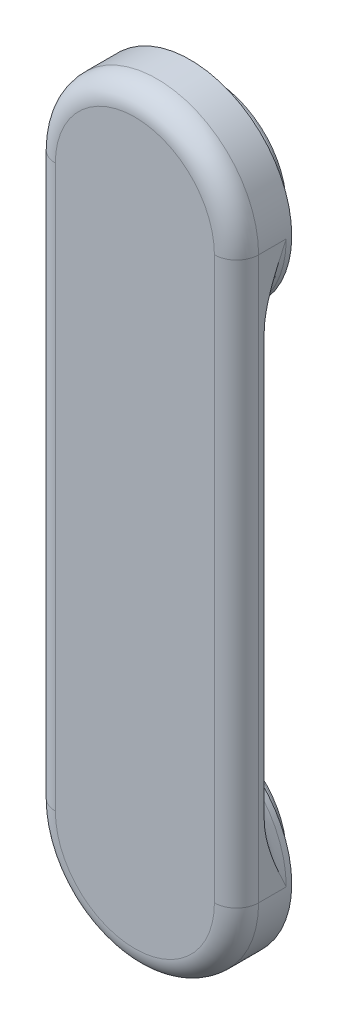
ISO-10303-21;
HEADER;
FILE_DESCRIPTION(('STEP AP214'),'2;1');
FILE_NAME('part.step','',(''),(''),'','','');
FILE_SCHEMA(('AUTOMOTIVE_DESIGN { 1 0 10303 214 1 1 1 1 }'));
ENDSEC;
DATA;
#1=APPLICATION_CONTEXT('core data for automotive mechanical design processes');
#2=APPLICATION_PROTOCOL_DEFINITION('international standard','automotive_design',2000,#1);
#3=PRODUCT_CONTEXT('',#1,'mechanical');
#4=PRODUCT('Part','Part','',(#3));
#5=PRODUCT_RELATED_PRODUCT_CATEGORY('part','',(#4));
#6=PRODUCT_DEFINITION_FORMATION('','',#4);
#7=PRODUCT_DEFINITION_CONTEXT('part definition',#1,'design');
#8=PRODUCT_DEFINITION('design','',#6,#7);
#9=PRODUCT_DEFINITION_SHAPE('','',#8);
#10=(LENGTH_UNIT() NAMED_UNIT(*) SI_UNIT(.MILLI.,.METRE.));
#11=(NAMED_UNIT(*) PLANE_ANGLE_UNIT() SI_UNIT($,.RADIAN.));
#12=(NAMED_UNIT(*) SI_UNIT($,.STERADIAN.) SOLID_ANGLE_UNIT());
#13=UNCERTAINTY_MEASURE_WITH_UNIT(LENGTH_MEASURE(1.E-05),#10,'distance_accuracy_value','');
#14=(GEOMETRIC_REPRESENTATION_CONTEXT(3) GLOBAL_UNCERTAINTY_ASSIGNED_CONTEXT((#13)) GLOBAL_UNIT_ASSIGNED_CONTEXT((#10,
#11,#12)) REPRESENTATION_CONTEXT('',''));
#15=CARTESIAN_POINT('',(0.,0.,0.));
#16=DIRECTION('',(0.,0.,1.));
#17=DIRECTION('',(1.,0.,0.));
#18=AXIS2_PLACEMENT_3D('',#15,#16,#17);
#19=CARTESIAN_POINT('',(0.,-31.75,3.125));
#20=DIRECTION('',(0.,0.,-1.));
#21=DIRECTION('',(-1.,0.,0.));
#22=AXIS2_PLACEMENT_3D('',#19,#20,#21);
#23=CYLINDRICAL_SURFACE('',#22,11.5);
#24=DIRECTION('',(0.,0.,-1.));
#25=VECTOR('',#24,1.);
#26=CARTESIAN_POINT('',(11.5,-31.75,3.125));
#27=LINE('',#26,#25);
#28=CARTESIAN_POINT('',(11.5,-31.75,0.625));
#29=VERTEX_POINT('',#28);
#30=CARTESIAN_POINT('',(11.5,-31.75,-2.5));
#31=VERTEX_POINT('',#30);
#32=EDGE_CURVE('E134',#29,#31,#27,.T.);
#33=ORIENTED_EDGE('',*,*,#32,.F.);
#34=CARTESIAN_POINT('',(0.,-31.75,0.625));
#35=DIRECTION('',(0.,0.,1.));
#36=DIRECTION('',(1.,0.,0.));
#37=AXIS2_PLACEMENT_3D('',#34,#35,#36);
#38=CIRCLE('',#37,11.5);
#39=CARTESIAN_POINT('',(-11.5,-31.75,0.625));
#40=VERTEX_POINT('',#39);
#41=EDGE_CURVE('E119',#29,#40,#38,.F.);
#42=ORIENTED_EDGE('',*,*,#41,.T.);
#43=DIRECTION('',(0.,0.,-1.));
#44=VECTOR('',#43,1.);
#45=CARTESIAN_POINT('',(-11.5,-31.75,3.125));
#46=LINE('',#45,#44);
#47=CARTESIAN_POINT('',(-11.5,-31.75,-2.5));
#48=VERTEX_POINT('',#47);
#49=EDGE_CURVE('E325',#40,#48,#46,.T.);
#50=ORIENTED_EDGE('',*,*,#49,.T.);
#51=CARTESIAN_POINT('',(0.,-31.75,-2.5));
#52=DIRECTION('',(0.,0.,1.));
#53=DIRECTION('',(1.,0.,0.));
#54=AXIS2_PLACEMENT_3D('',#51,#52,#53);
#55=CIRCLE('',#54,11.5);
#56=EDGE_CURVE('E141',#48,#31,#55,.F.);
#57=ORIENTED_EDGE('',*,*,#56,.T.);
#58=EDGE_LOOP('',(#33,#42,#50,#57));
#59=FACE_BOUND('',#58,.T.);
#60=CARTESIAN_POINT('',(0.,-31.75,-3.125));
#61=DIRECTION('',(0.,0.,1.));
#62=DIRECTION('',(1.,0.,0.));
#63=AXIS2_PLACEMENT_3D('',#60,#61,#62);
#64=CIRCLE('',#63,11.5);
#65=CARTESIAN_POINT('',(11.5,-31.75,-3.125));
#66=VERTEX_POINT('',#65);
#67=EDGE_CURVE('E310',#66,#66,#64,.T.);
#68=ORIENTED_EDGE('',*,*,#67,.T.);
#69=EDGE_LOOP('',(#68));
#70=FACE_BOUND('',#69,.T.);
#71=ADVANCED_FACE('F43',(#59,#70),#23,.T.);
#72=CARTESIAN_POINT('',(11.5,-31.75,3.125));
#73=DIRECTION('',(-1.,0.,0.));
#74=DIRECTION('',(0.,-1.,0.));
#75=AXIS2_PLACEMENT_3D('',#72,#73,#74);
#76=PLANE('',#75);
#77=DIRECTION('',(0.,0.,-1.));
#78=VECTOR('',#77,1.);
#79=CARTESIAN_POINT('',(11.5,31.75,3.125));
#80=LINE('',#79,#78);
#81=CARTESIAN_POINT('',(11.5,31.75,0.625));
#82=VERTEX_POINT('',#81);
#83=CARTESIAN_POINT('',(11.5,31.75,-2.5));
#84=VERTEX_POINT('',#83);
#85=EDGE_CURVE('E273',#82,#84,#80,.T.);
#86=ORIENTED_EDGE('',*,*,#85,.F.);
#87=DIRECTION('',(0.,1.,0.));
#88=VECTOR('',#87,1.);
#89=CARTESIAN_POINT('',(11.5,-31.75,0.625));
#90=LINE('',#89,#88);
#91=EDGE_CURVE('E162',#82,#29,#90,.F.);
#92=ORIENTED_EDGE('',*,*,#91,.T.);
#93=ORIENTED_EDGE('',*,*,#32,.T.);
#94=CARTESIAN_POINT('',(11.5,-23.7656402886643,0.));
#95=CARTESIAN_POINT('',(11.5,-23.9112332765883,-1.69908867049003E-05));
#96=CARTESIAN_POINT('',(11.5,-24.056780865209,-0.00413564646090326));
#97=CARTESIAN_POINT('',(11.5,-24.3473991352482,-0.0197827491517628));
#98=CARTESIAN_POINT('',(11.5,-24.4924700442411,-0.0313068988774172));
#99=CARTESIAN_POINT('',(11.5,-24.7815009163115,-0.0609305173504692));
#100=CARTESIAN_POINT('',(11.5,-24.9254628768635,-0.0790109239362852));
#101=CARTESIAN_POINT('',(11.5,-25.21253268519,-0.121081398249559));
#102=CARTESIAN_POINT('',(11.5,-25.3556403926035,-0.145072411174061));
#103=CARTESIAN_POINT('',(11.5,-25.7800827335397,-0.224345309413682));
#104=CARTESIAN_POINT('',(11.5,-26.0599959733642,-0.287312732189337));
#105=CARTESIAN_POINT('',(11.5,-26.6156937928833,-0.429871238840553));
#106=CARTESIAN_POINT('',(11.5,-26.8914746704327,-0.509476373420187));
#107=CARTESIAN_POINT('',(11.5,-27.557721963974,-0.719328390781007));
#108=CARTESIAN_POINT('',(11.5,-27.9459758666787,-0.856553607015504));
#109=CARTESIAN_POINT('',(11.5,-28.7151363990286,-1.14983582712574));
#110=CARTESIAN_POINT('',(11.5,-29.0960429631535,-1.30589299884675));
#111=CARTESIAN_POINT('',(11.5,-30.2334696101406,-1.79296918468285));
#112=CARTESIAN_POINT('',(11.5,-30.9821411112047,-2.1419844139502));
#113=CARTESIAN_POINT('',(11.5,-31.7370409800875,-2.49395784005255));
#114=CARTESIAN_POINT('',(11.5,-31.7435204961502,-2.49697893017245));
#115=CARTESIAN_POINT('',(11.5,-31.75,-2.5));
#116=B_SPLINE_CURVE_WITH_KNOTS('',3,(#94,#95,#96,#97,#98,#99,#100,#101,#102,#103,#104,#105,#106,
#107,#108,#109,#110,#111,#112,#113,#114,#115),.UNSPECIFIED.,.F.,.F.,(4,2,2,2,2,2,2,2,2,2,4),(0.,
0.436655710143634,0.873058258536552,1.3082020189555,1.74341541078733,2.60342762133257,
3.46416907639028,4.69875550959814,5.93335294722909,8.41066469203298,8.43211230262252),.UNSPECIFIED.);
#117=CARTESIAN_POINT('',(11.5,-23.7656402886643,0.));
#118=VERTEX_POINT('',#117);
#119=EDGE_CURVE('E68',#31,#118,#116,.F.);
#120=ORIENTED_EDGE('',*,*,#119,.T.);
#121=DIRECTION('',(0.,1.,0.));
#122=VECTOR('',#121,1.);
#123=CARTESIAN_POINT('',(11.5,-31.75,0.));
#124=LINE('',#123,#122);
#125=CARTESIAN_POINT('',(11.5,23.7656402886643,0.));
#126=VERTEX_POINT('',#125);
#127=EDGE_CURVE('E318',#118,#126,#124,.T.);
#128=ORIENTED_EDGE('',*,*,#127,.T.);
#129=CARTESIAN_POINT('',(11.5,23.7656402886643,0.));
#130=CARTESIAN_POINT('',(11.5,23.9112332765897,-1.69908867060878E-05));
#131=CARTESIAN_POINT('',(11.5,24.0567808652118,-0.00413564646098504));
#132=CARTESIAN_POINT('',(11.5,24.3473991352539,-0.0197827491521442));
#133=CARTESIAN_POINT('',(11.5,24.4924700442483,-0.0313068988780174));
#134=CARTESIAN_POINT('',(11.5,24.7815009163211,-0.0609305173515929));
#135=CARTESIAN_POINT('',(11.5,24.9254628768743,-0.0790109239376994));
#136=CARTESIAN_POINT('',(11.5,25.2125326852029,-0.121081398251619));
#137=CARTESIAN_POINT('',(11.5,25.3556403926175,-0.145072411176477));
#138=CARTESIAN_POINT('',(11.5,25.780082733552,-0.224345309416388));
#139=CARTESIAN_POINT('',(11.5,26.0599959733737,-0.287312732191754));
#140=CARTESIAN_POINT('',(11.5,26.6156937928879,-0.429871238841785));
#141=CARTESIAN_POINT('',(11.5,26.8914746704351,-0.50947637342054));
#142=CARTESIAN_POINT('',(11.5,27.5577219639734,-0.719328390781427));
#143=CARTESIAN_POINT('',(11.5,27.9459758666769,-0.856553607017628));
#144=CARTESIAN_POINT('',(11.5,28.7151363990278,-1.14983582712267));
#145=CARTESIAN_POINT('',(11.5,29.0960429631549,-1.30589299883675));
#146=CARTESIAN_POINT('',(11.4999999999999,30.2334696101298,-1.79296918469958));
#147=CARTESIAN_POINT('',(11.4999999999995,30.9821411111579,-2.14198441404739));
#148=CARTESIAN_POINT('',(11.5,31.7370409800867,-2.49395784005423));
#149=CARTESIAN_POINT('',(11.5,31.7435204961498,-2.4969789301733));
#150=CARTESIAN_POINT('',(11.5,31.75,-2.5));
#151=B_SPLINE_CURVE_WITH_KNOTS('',3,(#129,#130,#131,#132,#133,#134,#135,#136,#137,#138,#139,
#140,#141,#142,#143,#144,#145,#146,#147,#148,#149,#150),.UNSPECIFIED.,.F.,.F.,(4,2,2,2,2,2,2,2,
2,2,4),(0.,0.436655710147938,0.873058258545157,1.30820201896747,1.74341541080268,
2.60342762133974,3.46416907639027,4.69875550959711,5.93335294722513,8.41066469203293,
8.43211230262251),.UNSPECIFIED.);
#152=EDGE_CURVE('E53',#126,#84,#151,.T.);
#153=ORIENTED_EDGE('',*,*,#152,.T.);
#154=EDGE_LOOP('',(#86,#92,#93,#120,#128,#153));
#155=FACE_BOUND('',#154,.T.);
#156=ADVANCED_FACE('F241',(#155),#76,.F.);
#157=CARTESIAN_POINT('',(0.,31.75,3.125));
#158=DIRECTION('',(0.,0.,-1.));
#159=DIRECTION('',(-1.,0.,0.));
#160=AXIS2_PLACEMENT_3D('',#157,#158,#159);
#161=CYLINDRICAL_SURFACE('',#160,11.5);
#162=DIRECTION('',(0.,0.,-1.));
#163=VECTOR('',#162,1.);
#164=CARTESIAN_POINT('',(-11.5,31.75,3.125));
#165=LINE('',#164,#163);
#166=CARTESIAN_POINT('',(-11.5,31.75,0.625));
#167=VERTEX_POINT('',#166);
#168=CARTESIAN_POINT('',(-11.5,31.75,-2.5));
#169=VERTEX_POINT('',#168);
#170=EDGE_CURVE('E279',#167,#169,#165,.T.);
#171=ORIENTED_EDGE('',*,*,#170,.F.);
#172=CARTESIAN_POINT('',(0.,31.75,0.625));
#173=DIRECTION('',(0.,0.,1.));
#174=DIRECTION('',(1.,0.,0.));
#175=AXIS2_PLACEMENT_3D('',#172,#173,#174);
#176=CIRCLE('',#175,11.5);
#177=EDGE_CURVE('E159',#167,#82,#176,.F.);
#178=ORIENTED_EDGE('',*,*,#177,.T.);
#179=ORIENTED_EDGE('',*,*,#85,.T.);
#180=CARTESIAN_POINT('',(0.,31.75,-2.5));
#181=DIRECTION('',(0.,0.,1.));
#182=DIRECTION('',(1.,0.,0.));
#183=AXIS2_PLACEMENT_3D('',#180,#181,#182);
#184=CIRCLE('',#183,11.5);
#185=EDGE_CURVE('E155',#84,#169,#184,.F.);
#186=ORIENTED_EDGE('',*,*,#185,.T.);
#187=EDGE_LOOP('',(#171,#178,#179,#186));
#188=FACE_BOUND('',#187,.T.);
#189=CARTESIAN_POINT('',(0.,31.75,-3.125));
#190=DIRECTION('',(0.,0.,1.));
#191=DIRECTION('',(1.,0.,0.));
#192=AXIS2_PLACEMENT_3D('',#189,#190,#191);
#193=CIRCLE('',#192,11.5);
#194=CARTESIAN_POINT('',(11.5,31.75,-3.125));
#195=VERTEX_POINT('',#194);
#196=EDGE_CURVE('E314',#195,#195,#193,.T.);
#197=ORIENTED_EDGE('',*,*,#196,.T.);
#198=EDGE_LOOP('',(#197));
#199=FACE_BOUND('',#198,.T.);
#200=ADVANCED_FACE('F213',(#188,#199),#161,.T.);
#201=CARTESIAN_POINT('',(-11.5,-31.75,3.125));
#202=DIRECTION('',(-1.,0.,0.));
#203=DIRECTION('',(0.,-1.,0.));
#204=AXIS2_PLACEMENT_3D('',#201,#202,#203);
#205=PLANE('',#204);
#206=ORIENTED_EDGE('',*,*,#49,.F.);
#207=DIRECTION('',(0.,1.,0.));
#208=VECTOR('',#207,1.);
#209=CARTESIAN_POINT('',(-11.5,-31.75,0.625));
#210=LINE('',#209,#208);
#211=EDGE_CURVE('E152',#40,#167,#210,.T.);
#212=ORIENTED_EDGE('',*,*,#211,.T.);
#213=ORIENTED_EDGE('',*,*,#170,.T.);
#214=CARTESIAN_POINT('',(-11.5,23.7656402886644,0.));
#215=CARTESIAN_POINT('',(-11.5,23.9112332765866,-1.69908867029895E-05));
#216=CARTESIAN_POINT('',(-11.5,24.0567808652056,-0.00413564646080526));
#217=CARTESIAN_POINT('',(-11.5,24.3473991352414,-0.0197827491513075));
#218=CARTESIAN_POINT('',(-11.5,24.4924700442326,-0.0313068988767003));
#219=CARTESIAN_POINT('',(-11.5,24.7815009162999,-0.0609305173491256));
#220=CARTESIAN_POINT('',(-11.5,24.9254628768506,-0.0790109239345935));
#221=CARTESIAN_POINT('',(-11.5,25.2125326851745,-0.121081398247092));
#222=CARTESIAN_POINT('',(-11.5,25.3556403925868,-0.145072411171168));
#223=CARTESIAN_POINT('',(-11.5,25.7800827335249,-0.224345309410443));
#224=CARTESIAN_POINT('',(-11.5,26.0599959733527,-0.287312732186443));
#225=CARTESIAN_POINT('',(-11.5,26.6156937928778,-0.429871238839078));
#226=CARTESIAN_POINT('',(-11.5,26.8914746704298,-0.509476373419765));
#227=CARTESIAN_POINT('',(-11.5,27.5577219639747,-0.719328390780504));
#228=CARTESIAN_POINT('',(-11.5,27.9459758666808,-0.856553607012958));
#229=CARTESIAN_POINT('',(-11.5,28.7151363990296,-1.14983582712941));
#230=CARTESIAN_POINT('',(-11.5,29.0960429631519,-1.30589299885872));
#231=CARTESIAN_POINT('',(-11.5000000000001,30.2334696101534,-1.79296918466283));
#232=CARTESIAN_POINT('',(-11.5000000000002,30.9821411112606,-2.14198441383391));
#233=CARTESIAN_POINT('',(-11.5,31.7370409800884,-2.49395784005052));
#234=CARTESIAN_POINT('',(-11.5,31.7435204961507,-2.49697893017143));
#235=CARTESIAN_POINT('',(-11.5,31.75,-2.5));
#236=B_SPLINE_CURVE_WITH_KNOTS('',3,(#214,#215,#216,#217,#218,#219,#220,#221,#222,#223,#224,
#225,#226,#227,#228,#229,#230,#231,#232,#233,#234,#235),.UNSPECIFIED.,.F.,.F.,(4,2,2,2,2,2,2,2,
2,2,4),(0.,0.436655710138497,0.87305825852626,1.30820201894116,1.74341541076897,
2.60342762132397,3.4641690763903,4.69875550959936,5.93335294723379,8.41066469203296,
8.43211230262254),.UNSPECIFIED.);
#237=CARTESIAN_POINT('',(-11.5,23.7656402886644,0.));
#238=VERTEX_POINT('',#237);
#239=EDGE_CURVE('E11',#169,#238,#236,.F.);
#240=ORIENTED_EDGE('',*,*,#239,.T.);
#241=DIRECTION('',(0.,1.,0.));
#242=VECTOR('',#241,1.);
#243=CARTESIAN_POINT('',(-11.5,-31.75,0.));
#244=LINE('',#243,#242);
#245=CARTESIAN_POINT('',(-11.5,-23.7656402886643,0.));
#246=VERTEX_POINT('',#245);
#247=EDGE_CURVE('E321',#246,#238,#244,.T.);
#248=ORIENTED_EDGE('',*,*,#247,.F.);
#249=CARTESIAN_POINT('',(-11.5,-23.7656402886643,0.));
#250=CARTESIAN_POINT('',(-11.5,-23.9112332765883,-1.69908867046995E-05));
#251=CARTESIAN_POINT('',(-11.5,-24.056780865209,-0.00413564646090278));
#252=CARTESIAN_POINT('',(-11.5,-24.3473991352482,-0.019782749151761));
#253=CARTESIAN_POINT('',(-11.5,-24.4924700442411,-0.0313068988774142));
#254=CARTESIAN_POINT('',(-11.5,-24.7815009163114,-0.0609305173504628));
#255=CARTESIAN_POINT('',(-11.5,-24.9254628768635,-0.0790109239362767));
#256=CARTESIAN_POINT('',(-11.5,-25.2125326851899,-0.121081398249547));
#257=CARTESIAN_POINT('',(-11.5,-25.3556403926035,-0.145072411174047));
#258=CARTESIAN_POINT('',(-11.5,-25.7800827335396,-0.224345309413669));
#259=CARTESIAN_POINT('',(-11.5,-26.0599959733641,-0.287312732189325));
#260=CARTESIAN_POINT('',(-11.5,-26.6156937928833,-0.429871238840548));
#261=CARTESIAN_POINT('',(-11.5,-26.8914746704327,-0.509476373420186));
#262=CARTESIAN_POINT('',(-11.5,-27.557721963974,-0.719328390781006));
#263=CARTESIAN_POINT('',(-11.5,-27.9459758666787,-0.856553607015494));
#264=CARTESIAN_POINT('',(-11.5,-28.7151363990286,-1.14983582712576));
#265=CARTESIAN_POINT('',(-11.5,-29.0960429631535,-1.3058929988468));
#266=CARTESIAN_POINT('',(-11.5,-30.2334696101406,-1.79296918468277));
#267=CARTESIAN_POINT('',(-11.5,-30.9821411112049,-2.14198441394972));
#268=CARTESIAN_POINT('',(-11.5,-31.7370409800875,-2.49395784005254));
#269=CARTESIAN_POINT('',(-11.5,-31.7435204961502,-2.49697893017244));
#270=CARTESIAN_POINT('',(-11.5,-31.75,-2.5));
#271=B_SPLINE_CURVE_WITH_KNOTS('',3,(#249,#250,#251,#252,#253,#254,#255,#256,#257,#258,#259,
#260,#261,#262,#263,#264,#265,#266,#267,#268,#269,#270),.UNSPECIFIED.,.F.,.F.,(4,2,2,2,2,2,2,2,
2,2,4),(0.,0.436655710143613,0.873058258536507,1.30820201895543,1.74341541078726,
2.60342762133253,3.46416907639029,4.69875550959815,5.93335294722911,8.41066469203297,
8.43211230262252),.UNSPECIFIED.);
#272=EDGE_CURVE('E188',#246,#48,#271,.T.);
#273=ORIENTED_EDGE('',*,*,#272,.T.);
#274=EDGE_LOOP('',(#206,#212,#213,#240,#248,#273));
#275=FACE_BOUND('',#274,.T.);
#276=ADVANCED_FACE('F208',(#275),#205,.T.);
#277=CARTESIAN_POINT('',(0.,-31.75,3.125));
#278=DIRECTION('',(0.,0.,1.));
#279=DIRECTION('',(1.,0.,0.));
#280=AXIS2_PLACEMENT_3D('',#277,#278,#279);
#281=PLANE('',#280);
#282=DIRECTION('',(0.,1.,0.));
#283=VECTOR('',#282,1.);
#284=CARTESIAN_POINT('',(-9.00000000000001,-31.75,3.125));
#285=LINE('',#284,#283);
#286=CARTESIAN_POINT('',(-9.00000000000001,31.75,3.125));
#287=VERTEX_POINT('',#286);
#288=CARTESIAN_POINT('',(-9.00000000000001,-31.75,3.125));
#289=VERTEX_POINT('',#288);
#290=EDGE_CURVE('E138',#287,#289,#285,.F.);
#291=ORIENTED_EDGE('',*,*,#290,.T.);
#292=CARTESIAN_POINT('',(0.,-31.75,3.125));
#293=DIRECTION('',(0.,0.,1.));
#294=DIRECTION('',(1.,0.,0.));
#295=AXIS2_PLACEMENT_3D('',#292,#293,#294);
#296=CIRCLE('',#295,9.00000000000001);
#297=CARTESIAN_POINT('',(9.00000000000001,-31.75,3.125));
#298=VERTEX_POINT('',#297);
#299=EDGE_CURVE('E117',#289,#298,#296,.T.);
#300=ORIENTED_EDGE('',*,*,#299,.T.);
#301=DIRECTION('',(0.,1.,0.));
#302=VECTOR('',#301,1.);
#303=CARTESIAN_POINT('',(8.99999999999999,31.75,3.125));
#304=LINE('',#303,#302);
#305=CARTESIAN_POINT('',(8.99999999999999,31.75,3.125));
#306=VERTEX_POINT('',#305);
#307=EDGE_CURVE('E126',#298,#306,#304,.T.);
#308=ORIENTED_EDGE('',*,*,#307,.T.);
#309=CARTESIAN_POINT('',(0.,31.75,3.125));
#310=DIRECTION('',(0.,0.,1.));
#311=DIRECTION('',(1.,0.,0.));
#312=AXIS2_PLACEMENT_3D('',#309,#310,#311);
#313=CIRCLE('',#312,9.00000000000001);
#314=EDGE_CURVE('E133',#306,#287,#313,.T.);
#315=ORIENTED_EDGE('',*,*,#314,.T.);
#316=EDGE_LOOP('',(#291,#300,#308,#315));
#317=FACE_BOUND('',#316,.T.);
#318=ADVANCED_FACE('F136',(#317),#281,.T.);
#319=CARTESIAN_POINT('',(0.,-31.75,0.));
#320=DIRECTION('',(0.,0.,1.));
#321=DIRECTION('',(1.,0.,0.));
#322=AXIS2_PLACEMENT_3D('',#319,#320,#321);
#323=PLANE('',#322);
#324=ORIENTED_EDGE('',*,*,#127,.F.);
#325=CARTESIAN_POINT('',(0.,-31.75,0.));
#326=DIRECTION('',(0.,0.,1.));
#327=DIRECTION('',(1.,0.,0.));
#328=AXIS2_PLACEMENT_3D('',#325,#326,#327);
#329=CIRCLE('',#328,14.);
#330=EDGE_CURVE('E168',#118,#246,#329,.T.);
#331=ORIENTED_EDGE('',*,*,#330,.T.);
#332=ORIENTED_EDGE('',*,*,#247,.T.);
#333=CARTESIAN_POINT('',(0.,31.75,0.));
#334=DIRECTION('',(0.,0.,1.));
#335=DIRECTION('',(1.,0.,0.));
#336=AXIS2_PLACEMENT_3D('',#333,#334,#335);
#337=CIRCLE('',#336,14.);
#338=EDGE_CURVE('E165',#238,#126,#337,.T.);
#339=ORIENTED_EDGE('',*,*,#338,.T.);
#340=EDGE_LOOP('',(#324,#331,#332,#339));
#341=FACE_BOUND('',#340,.T.);
#342=ADVANCED_FACE('F215',(#341),#323,.F.);
#343=CARTESIAN_POINT('',(0.,31.75,-3.125));
#344=DIRECTION('',(0.,0.,1.));
#345=DIRECTION('',(1.,0.,0.));
#346=AXIS2_PLACEMENT_3D('',#343,#344,#345);
#347=PLANE('',#346);
#348=CARTESIAN_POINT('',(0.,31.75,-3.125));
#349=DIRECTION('',(0.,0.,1.));
#350=DIRECTION('',(1.,0.,0.));
#351=AXIS2_PLACEMENT_3D('',#348,#349,#350);
#352=CIRCLE('',#351,10.75);
#353=CARTESIAN_POINT('',(10.75,31.75,-3.125));
#354=VERTEX_POINT('',#353);
#355=EDGE_CURVE('E180',#354,#354,#352,.T.);
#356=ORIENTED_EDGE('',*,*,#355,.T.);
#357=EDGE_LOOP('',(#356));
#358=FACE_BOUND('',#357,.T.);
#359=ORIENTED_EDGE('',*,*,#196,.F.);
#360=EDGE_LOOP('',(#359));
#361=FACE_BOUND('',#360,.T.);
#362=ADVANCED_FACE('F339',(#358,#361),#347,.F.);
#363=CARTESIAN_POINT('',(0.,-31.75,-3.125));
#364=DIRECTION('',(0.,0.,1.));
#365=DIRECTION('',(1.,0.,0.));
#366=AXIS2_PLACEMENT_3D('',#363,#364,#365);
#367=PLANE('',#366);
#368=CARTESIAN_POINT('',(0.,-31.75,-3.125));
#369=DIRECTION('',(0.,0.,1.));
#370=DIRECTION('',(1.,0.,0.));
#371=AXIS2_PLACEMENT_3D('',#368,#369,#370);
#372=CIRCLE('',#371,10.75);
#373=CARTESIAN_POINT('',(10.75,-31.75,-3.125));
#374=VERTEX_POINT('',#373);
#375=EDGE_CURVE('E172',#374,#374,#372,.T.);
#376=ORIENTED_EDGE('',*,*,#375,.T.);
#377=EDGE_LOOP('',(#376));
#378=FACE_BOUND('',#377,.T.);
#379=ORIENTED_EDGE('',*,*,#67,.F.);
#380=EDGE_LOOP('',(#379));
#381=FACE_BOUND('',#380,.T.);
#382=ADVANCED_FACE('F344',(#378,#381),#367,.F.);
#383=CARTESIAN_POINT('',(0.,31.75,-5.75));
#384=DIRECTION('',(0.,0.,1.));
#385=DIRECTION('',(1.,0.,0.));
#386=AXIS2_PLACEMENT_3D('',#383,#384,#385);
#387=CYLINDRICAL_SURFACE('',#386,8.25);
#388=CARTESIAN_POINT('',(0.,31.75,-5.625));
#389=DIRECTION('',(0.,0.,1.));
#390=DIRECTION('',(1.,0.,0.));
#391=AXIS2_PLACEMENT_3D('',#388,#389,#390);
#392=CIRCLE('',#391,8.25);
#393=CARTESIAN_POINT('',(8.25,31.75,-5.625));
#394=VERTEX_POINT('',#393);
#395=EDGE_CURVE('E184',#394,#394,#392,.F.);
#396=ORIENTED_EDGE('',*,*,#395,.T.);
#397=EDGE_LOOP('',(#396));
#398=FACE_BOUND('',#397,.T.);
#399=CARTESIAN_POINT('',(0.,31.75,-5.75));
#400=DIRECTION('',(0.,0.,1.));
#401=DIRECTION('',(1.,0.,0.));
#402=AXIS2_PLACEMENT_3D('',#399,#400,#401);
#403=CIRCLE('',#402,8.25);
#404=CARTESIAN_POINT('',(8.25,31.75,-5.75));
#405=VERTEX_POINT('',#404);
#406=EDGE_CURVE('E306',#405,#405,#403,.T.);
#407=ORIENTED_EDGE('',*,*,#406,.T.);
#408=EDGE_LOOP('',(#407));
#409=FACE_BOUND('',#408,.T.);
#410=ADVANCED_FACE('F352',(#398,#409),#387,.T.);
#411=CARTESIAN_POINT('',(0.,31.75,-5.75));
#412=DIRECTION('',(0.,0.,1.));
#413=DIRECTION('',(1.,0.,0.));
#414=AXIS2_PLACEMENT_3D('',#411,#412,#413);
#415=PLANE('',#414);
#416=CARTESIAN_POINT('',(0.,31.75,-5.75));
#417=DIRECTION('',(0.,0.,-1.));
#418=DIRECTION('',(-1.,0.,0.));
#419=AXIS2_PLACEMENT_3D('',#416,#417,#418);
#420=CIRCLE('',#419,7.5);
#421=CARTESIAN_POINT('',(-7.5,31.75,-5.75));
#422=VERTEX_POINT('',#421);
#423=EDGE_CURVE('E294',#422,#422,#420,.T.);
#424=ORIENTED_EDGE('',*,*,#423,.F.);
#425=EDGE_LOOP('',(#424));
#426=FACE_BOUND('',#425,.T.);
#427=ORIENTED_EDGE('',*,*,#406,.F.);
#428=EDGE_LOOP('',(#427));
#429=FACE_BOUND('',#428,.T.);
#430=ADVANCED_FACE('F356',(#426,#429),#415,.F.);
#431=CARTESIAN_POINT('',(0.,-31.75,-5.75));
#432=DIRECTION('',(0.,0.,1.));
#433=DIRECTION('',(1.,0.,0.));
#434=AXIS2_PLACEMENT_3D('',#431,#432,#433);
#435=CYLINDRICAL_SURFACE('',#434,8.25);
#436=CARTESIAN_POINT('',(0.,-31.75,-5.625));
#437=DIRECTION('',(0.,0.,1.));
#438=DIRECTION('',(1.,0.,0.));
#439=AXIS2_PLACEMENT_3D('',#436,#437,#438);
#440=CIRCLE('',#439,8.25);
#441=CARTESIAN_POINT('',(8.25,-31.75,-5.625));
#442=VERTEX_POINT('',#441);
#443=EDGE_CURVE('E176',#442,#442,#440,.F.);
#444=ORIENTED_EDGE('',*,*,#443,.T.);
#445=EDGE_LOOP('',(#444));
#446=FACE_BOUND('',#445,.T.);
#447=CARTESIAN_POINT('',(0.,-31.75,-5.75));
#448=DIRECTION('',(0.,0.,1.));
#449=DIRECTION('',(1.,0.,0.));
#450=AXIS2_PLACEMENT_3D('',#447,#448,#449);
#451=CIRCLE('',#450,8.25);
#452=CARTESIAN_POINT('',(8.25,-31.75,-5.75));
#453=VERTEX_POINT('',#452);
#454=EDGE_CURVE('E302',#453,#453,#451,.T.);
#455=ORIENTED_EDGE('',*,*,#454,.T.);
#456=EDGE_LOOP('',(#455));
#457=FACE_BOUND('',#456,.T.);
#458=ADVANCED_FACE('F360',(#446,#457),#435,.T.);
#459=CARTESIAN_POINT('',(0.,-31.75,-5.75));
#460=DIRECTION('',(0.,0.,1.));
#461=DIRECTION('',(1.,0.,0.));
#462=AXIS2_PLACEMENT_3D('',#459,#460,#461);
#463=PLANE('',#462);
#464=CARTESIAN_POINT('',(0.,-31.75,-5.75));
#465=DIRECTION('',(0.,0.,-1.));
#466=DIRECTION('',(-1.,0.,0.));
#467=AXIS2_PLACEMENT_3D('',#464,#465,#466);
#468=CIRCLE('',#467,7.5);
#469=CARTESIAN_POINT('',(-7.5,-31.75,-5.75));
#470=VERTEX_POINT('',#469);
#471=EDGE_CURVE('E290',#470,#470,#468,.T.);
#472=ORIENTED_EDGE('',*,*,#471,.F.);
#473=EDGE_LOOP('',(#472));
#474=FACE_BOUND('',#473,.T.);
#475=ORIENTED_EDGE('',*,*,#454,.F.);
#476=EDGE_LOOP('',(#475));
#477=FACE_BOUND('',#476,.T.);
#478=ADVANCED_FACE('F362',(#474,#477),#463,.F.);
#479=CARTESIAN_POINT('',(0.,-31.75,0.));
#480=DIRECTION('',(0.,0.,-1.));
#481=DIRECTION('',(-1.,0.,0.));
#482=AXIS2_PLACEMENT_3D('',#479,#480,#481);
#483=CYLINDRICAL_SURFACE('',#482,7.5);
#484=CARTESIAN_POINT('',(0.,-31.75,0.));
#485=DIRECTION('',(0.,0.,-1.));
#486=DIRECTION('',(-1.,0.,0.));
#487=AXIS2_PLACEMENT_3D('',#484,#485,#486);
#488=CIRCLE('',#487,7.5);
#489=CARTESIAN_POINT('',(-7.5,-31.75,0.));
#490=VERTEX_POINT('',#489);
#491=EDGE_CURVE('E285',#490,#490,#488,.T.);
#492=ORIENTED_EDGE('',*,*,#491,.F.);
#493=EDGE_LOOP('',(#492));
#494=FACE_BOUND('',#493,.T.);
#495=ORIENTED_EDGE('',*,*,#471,.T.);
#496=EDGE_LOOP('',(#495));
#497=FACE_BOUND('',#496,.T.);
#498=ADVANCED_FACE('F365',(#494,#497),#483,.F.);
#499=CARTESIAN_POINT('',(0.,-31.75,0.));
#500=DIRECTION('',(0.,0.,-1.));
#501=DIRECTION('',(-1.,0.,0.));
#502=AXIS2_PLACEMENT_3D('',#499,#500,#501);
#503=PLANE('',#502);
#504=ORIENTED_EDGE('',*,*,#491,.T.);
#505=EDGE_LOOP('',(#504));
#506=FACE_BOUND('',#505,.T.);
#507=ADVANCED_FACE('F370',(#506),#503,.T.);
#508=CARTESIAN_POINT('',(0.,31.75,0.));
#509=DIRECTION('',(0.,0.,-1.));
#510=DIRECTION('',(-1.,0.,0.));
#511=AXIS2_PLACEMENT_3D('',#508,#509,#510);
#512=CYLINDRICAL_SURFACE('',#511,7.5);
#513=CARTESIAN_POINT('',(0.,31.75,0.));
#514=DIRECTION('',(0.,0.,-1.));
#515=DIRECTION('',(-1.,0.,0.));
#516=AXIS2_PLACEMENT_3D('',#513,#514,#515);
#517=CIRCLE('',#516,7.5);
#518=CARTESIAN_POINT('',(-7.5,31.75,0.));
#519=VERTEX_POINT('',#518);
#520=EDGE_CURVE('E298',#519,#519,#517,.T.);
#521=ORIENTED_EDGE('',*,*,#520,.F.);
#522=EDGE_LOOP('',(#521));
#523=FACE_BOUND('',#522,.T.);
#524=ORIENTED_EDGE('',*,*,#423,.T.);
#525=EDGE_LOOP('',(#524));
#526=FACE_BOUND('',#525,.T.);
#527=ADVANCED_FACE('F265',(#523,#526),#512,.F.);
#528=CARTESIAN_POINT('',(0.,31.75,0.));
#529=DIRECTION('',(0.,0.,-1.));
#530=DIRECTION('',(-1.,0.,0.));
#531=AXIS2_PLACEMENT_3D('',#528,#529,#530);
#532=PLANE('',#531);
#533=ORIENTED_EDGE('',*,*,#520,.T.);
#534=EDGE_LOOP('',(#533));
#535=FACE_BOUND('',#534,.T.);
#536=ADVANCED_FACE('F260',(#535),#532,.T.);
#537=CARTESIAN_POINT('',(0.,31.75,0.625));
#538=DIRECTION('',(0.,0.,1.));
#539=DIRECTION('',(1.,0.,0.));
#540=AXIS2_PLACEMENT_3D('',#537,#538,#539);
#541=TOROIDAL_SURFACE('',#540,9.00000000000001,2.5);
#542=CARTESIAN_POINT('',(9.00000000000001,31.75,0.625));
#543=DIRECTION('',(0.,-1.,0.));
#544=DIRECTION('',(0.,0.,-1.));
#545=AXIS2_PLACEMENT_3D('',#542,#543,#544);
#546=CIRCLE('',#545,2.5);
#547=EDGE_CURVE('E129',#82,#306,#546,.T.);
#548=ORIENTED_EDGE('',*,*,#547,.F.);
#549=ORIENTED_EDGE('',*,*,#177,.F.);
#550=CARTESIAN_POINT('',(-9.00000000000001,31.75,0.625));
#551=DIRECTION('',(0.,-1.,0.));
#552=DIRECTION('',(0.,0.,-1.));
#553=AXIS2_PLACEMENT_3D('',#550,#551,#552);
#554=CIRCLE('',#553,2.5);
#555=EDGE_CURVE('E47',#287,#167,#554,.T.);
#556=ORIENTED_EDGE('',*,*,#555,.F.);
#557=ORIENTED_EDGE('',*,*,#314,.F.);
#558=EDGE_LOOP('',(#548,#549,#556,#557));
#559=FACE_BOUND('',#558,.T.);
#560=ADVANCED_FACE('F257',(#559),#541,.T.);
#561=CARTESIAN_POINT('',(-9.00000000000001,-31.75,0.625));
#562=DIRECTION('',(0.,1.,0.));
#563=DIRECTION('',(-1.,0.,0.));
#564=AXIS2_PLACEMENT_3D('',#561,#562,#563);
#565=CYLINDRICAL_SURFACE('',#564,2.5);
#566=ORIENTED_EDGE('',*,*,#555,.T.);
#567=ORIENTED_EDGE('',*,*,#211,.F.);
#568=CARTESIAN_POINT('',(-9.00000000000001,-31.75,0.625));
#569=DIRECTION('',(0.,-1.,0.));
#570=DIRECTION('',(0.,0.,-1.));
#571=AXIS2_PLACEMENT_3D('',#568,#569,#570);
#572=CIRCLE('',#571,2.5);
#573=EDGE_CURVE('E123',#289,#40,#572,.T.);
#574=ORIENTED_EDGE('',*,*,#573,.F.);
#575=ORIENTED_EDGE('',*,*,#290,.F.);
#576=EDGE_LOOP('',(#566,#567,#574,#575));
#577=FACE_BOUND('',#576,.T.);
#578=ADVANCED_FACE('F255',(#577),#565,.T.);
#579=CARTESIAN_POINT('',(9.00000000000001,-31.75,0.625));
#580=DIRECTION('',(0.,-1.,0.));
#581=DIRECTION('',(1.,0.,0.));
#582=AXIS2_PLACEMENT_3D('',#579,#580,#581);
#583=CYLINDRICAL_SURFACE('',#582,2.5);
#584=ORIENTED_EDGE('',*,*,#547,.T.);
#585=ORIENTED_EDGE('',*,*,#307,.F.);
#586=CARTESIAN_POINT('',(9.00000000000001,-31.75,0.625));
#587=DIRECTION('',(0.,-1.,0.));
#588=DIRECTION('',(0.,0.,-1.));
#589=AXIS2_PLACEMENT_3D('',#586,#587,#588);
#590=CIRCLE('',#589,2.5);
#591=EDGE_CURVE('E113',#29,#298,#590,.T.);
#592=ORIENTED_EDGE('',*,*,#591,.F.);
#593=ORIENTED_EDGE('',*,*,#91,.F.);
#594=EDGE_LOOP('',(#584,#585,#592,#593));
#595=FACE_BOUND('',#594,.T.);
#596=ADVANCED_FACE('F127',(#595),#583,.T.);
#597=CARTESIAN_POINT('',(0.,-31.75,0.625));
#598=DIRECTION('',(0.,0.,1.));
#599=DIRECTION('',(1.,0.,0.));
#600=AXIS2_PLACEMENT_3D('',#597,#598,#599);
#601=TOROIDAL_SURFACE('',#600,9.00000000000001,2.5);
#602=ORIENTED_EDGE('',*,*,#573,.T.);
#603=ORIENTED_EDGE('',*,*,#41,.F.);
#604=ORIENTED_EDGE('',*,*,#591,.T.);
#605=ORIENTED_EDGE('',*,*,#299,.F.);
#606=EDGE_LOOP('',(#602,#603,#604,#605));
#607=FACE_BOUND('',#606,.T.);
#608=ADVANCED_FACE('F115',(#607),#601,.T.);
#609=CARTESIAN_POINT('',(0.,-31.75,-2.5));
#610=DIRECTION('',(0.,0.,1.));
#611=DIRECTION('',(1.,0.,0.));
#612=AXIS2_PLACEMENT_3D('',#609,#610,#611);
#613=TOROIDAL_SURFACE('',#612,14.,2.5);
#614=ORIENTED_EDGE('',*,*,#119,.F.);
#615=ORIENTED_EDGE('',*,*,#56,.F.);
#616=ORIENTED_EDGE('',*,*,#272,.F.);
#617=ORIENTED_EDGE('',*,*,#330,.F.);
#618=EDGE_LOOP('',(#614,#615,#616,#617));
#619=FACE_BOUND('',#618,.T.);
#620=ADVANCED_FACE('F204',(#619),#613,.F.);
#621=CARTESIAN_POINT('',(0.,-31.75,-5.625));
#622=DIRECTION('',(0.,0.,1.));
#623=DIRECTION('',(1.,0.,0.));
#624=AXIS2_PLACEMENT_3D('',#621,#622,#623);
#625=TOROIDAL_SURFACE('',#624,10.75,2.5);
#626=ORIENTED_EDGE('',*,*,#443,.F.);
#627=EDGE_LOOP('',(#626));
#628=FACE_BOUND('',#627,.T.);
#629=ORIENTED_EDGE('',*,*,#375,.F.);
#630=EDGE_LOOP('',(#629));
#631=FACE_BOUND('',#630,.T.);
#632=ADVANCED_FACE('F230',(#628,#631),#625,.F.);
#633=CARTESIAN_POINT('',(0.,31.75,-2.5));
#634=DIRECTION('',(0.,0.,1.));
#635=DIRECTION('',(1.,0.,0.));
#636=AXIS2_PLACEMENT_3D('',#633,#634,#635);
#637=TOROIDAL_SURFACE('',#636,14.,2.5);
#638=ORIENTED_EDGE('',*,*,#239,.F.);
#639=ORIENTED_EDGE('',*,*,#185,.F.);
#640=ORIENTED_EDGE('',*,*,#152,.F.);
#641=ORIENTED_EDGE('',*,*,#338,.F.);
#642=EDGE_LOOP('',(#638,#639,#640,#641));
#643=FACE_BOUND('',#642,.T.);
#644=ADVANCED_FACE('F227',(#643),#637,.F.);
#645=CARTESIAN_POINT('',(0.,31.75,-5.625));
#646=DIRECTION('',(0.,0.,1.));
#647=DIRECTION('',(1.,0.,0.));
#648=AXIS2_PLACEMENT_3D('',#645,#646,#647);
#649=TOROIDAL_SURFACE('',#648,10.75,2.5);
#650=ORIENTED_EDGE('',*,*,#395,.F.);
#651=EDGE_LOOP('',(#650));
#652=FACE_BOUND('',#651,.T.);
#653=ORIENTED_EDGE('',*,*,#355,.F.);
#654=EDGE_LOOP('',(#653));
#655=FACE_BOUND('',#654,.T.);
#656=ADVANCED_FACE('F45',(#652,#655),#649,.F.);
#657=CLOSED_SHELL('',(#71,#156,#200,#276,#318,#342,#362,#382,#410,#430,#458,#478,#498,#507,#527,
#536,#560,#578,#596,#608,#620,#632,#644,#656));
#658=MANIFOLD_SOLID_BREP('B2',#657);
#659=ADVANCED_BREP_SHAPE_REPRESENTATION('',(#18,#658),#14);
#660=SHAPE_DEFINITION_REPRESENTATION(#9,#659);
ENDSEC;
END-ISO-10303-21;
